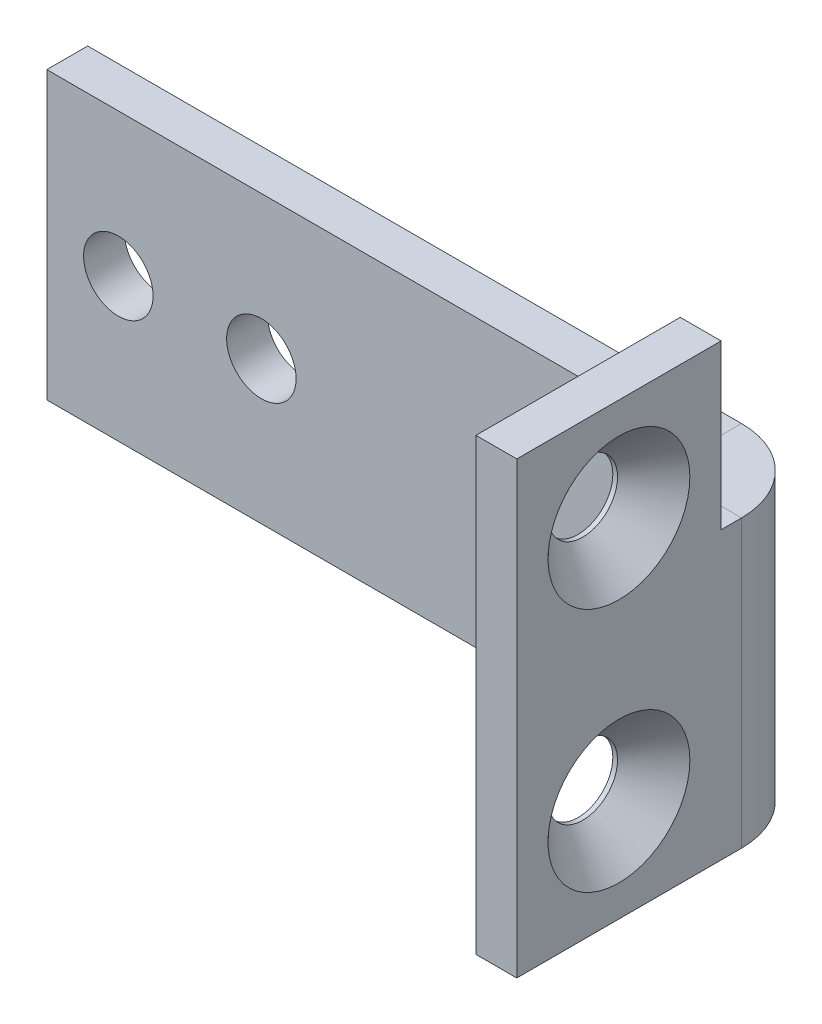
ISO-10303-21;
HEADER;
FILE_DESCRIPTION(('STEP AP214'),'2;1');
FILE_NAME('part.step','',(''),(''),'','','');
FILE_SCHEMA(('AUTOMOTIVE_DESIGN { 1 0 10303 214 1 1 1 1 }'));
ENDSEC;
DATA;
#1=APPLICATION_CONTEXT('core data for automotive mechanical design processes');
#2=APPLICATION_PROTOCOL_DEFINITION('international standard','automotive_design',2000,#1);
#3=PRODUCT_CONTEXT('',#1,'mechanical');
#4=PRODUCT('Part','Part','',(#3));
#5=PRODUCT_RELATED_PRODUCT_CATEGORY('part','',(#4));
#6=PRODUCT_DEFINITION_FORMATION('','',#4);
#7=PRODUCT_DEFINITION_CONTEXT('part definition',#1,'design');
#8=PRODUCT_DEFINITION('design','',#6,#7);
#9=PRODUCT_DEFINITION_SHAPE('','',#8);
#10=(LENGTH_UNIT() NAMED_UNIT(*) SI_UNIT(.MILLI.,.METRE.));
#11=(NAMED_UNIT(*) PLANE_ANGLE_UNIT() SI_UNIT($,.RADIAN.));
#12=(NAMED_UNIT(*) SI_UNIT($,.STERADIAN.) SOLID_ANGLE_UNIT());
#13=UNCERTAINTY_MEASURE_WITH_UNIT(LENGTH_MEASURE(1.E-05),#10,'distance_accuracy_value','');
#14=(GEOMETRIC_REPRESENTATION_CONTEXT(3) GLOBAL_UNCERTAINTY_ASSIGNED_CONTEXT((#13)) GLOBAL_UNIT_ASSIGNED_CONTEXT((#10,
#11,#12)) REPRESENTATION_CONTEXT('',''));
#15=CARTESIAN_POINT('',(0.,0.,0.));
#16=DIRECTION('',(0.,0.,1.));
#17=DIRECTION('',(1.,0.,0.));
#18=AXIS2_PLACEMENT_3D('',#15,#16,#17);
#19=CARTESIAN_POINT('',(0.,14.,-2.));
#20=DIRECTION('',(0.,1.,0.));
#21=DIRECTION('',(0.,0.,1.));
#22=AXIS2_PLACEMENT_3D('',#19,#20,#21);
#23=PLANE('',#22);
#24=DIRECTION('',(-1.,0.,0.));
#25=VECTOR('',#24,1.);
#26=CARTESIAN_POINT('',(0.,14.,0.));
#27=LINE('',#26,#25);
#28=CARTESIAN_POINT('',(32.,14.,0.));
#29=VERTEX_POINT('',#28);
#30=CARTESIAN_POINT('',(0.,14.,0.));
#31=VERTEX_POINT('',#30);
#32=EDGE_CURVE('E76',#29,#31,#27,.T.);
#33=ORIENTED_EDGE('',*,*,#32,.F.);
#34=DIRECTION('',(0.,0.,-1.));
#35=VECTOR('',#34,1.);
#36=CARTESIAN_POINT('',(32.,14.,0.));
#37=LINE('',#36,#35);
#38=CARTESIAN_POINT('',(32.,14.,-2.));
#39=VERTEX_POINT('',#38);
#40=EDGE_CURVE('E94',#29,#39,#37,.T.);
#41=ORIENTED_EDGE('',*,*,#40,.T.);
#42=DIRECTION('',(-1.,0.,0.));
#43=VECTOR('',#42,1.);
#44=CARTESIAN_POINT('',(0.,14.,-2.));
#45=LINE('',#44,#43);
#46=CARTESIAN_POINT('',(0.,14.,-2.));
#47=VERTEX_POINT('',#46);
#48=EDGE_CURVE('E61',#39,#47,#45,.T.);
#49=ORIENTED_EDGE('',*,*,#48,.T.);
#50=DIRECTION('',(0.,0.,1.));
#51=VECTOR('',#50,1.);
#52=CARTESIAN_POINT('',(0.,14.,-2.));
#53=LINE('',#52,#51);
#54=EDGE_CURVE('E11',#47,#31,#53,.T.);
#55=ORIENTED_EDGE('',*,*,#54,.T.);
#56=EDGE_LOOP('',(#33,#41,#49,#55));
#57=FACE_BOUND('',#56,.T.);
#58=ADVANCED_FACE('F36',(#57),#23,.T.);
#59=CARTESIAN_POINT('',(0.,0.,-2.));
#60=DIRECTION('',(0.,0.,-1.));
#61=DIRECTION('',(-1.,0.,0.));
#62=AXIS2_PLACEMENT_3D('',#59,#60,#61);
#63=PLANE('',#62);
#64=CARTESIAN_POINT('',(10.5,7.,-2.));
#65=DIRECTION('',(0.,0.,1.));
#66=DIRECTION('',(1.,0.,0.));
#67=AXIS2_PLACEMENT_3D('',#64,#65,#66);
#68=CIRCLE('',#67,1.7);
#69=CARTESIAN_POINT('',(12.2,7.,-2.));
#70=VERTEX_POINT('',#69);
#71=EDGE_CURVE('E106',#70,#70,#68,.T.);
#72=ORIENTED_EDGE('',*,*,#71,.T.);
#73=EDGE_LOOP('',(#72));
#74=FACE_BOUND('',#73,.T.);
#75=CARTESIAN_POINT('',(3.5,7.,-2.));
#76=DIRECTION('',(0.,0.,1.));
#77=DIRECTION('',(1.,0.,0.));
#78=AXIS2_PLACEMENT_3D('',#75,#76,#77);
#79=CIRCLE('',#78,1.7);
#80=CARTESIAN_POINT('',(5.2,7.,-2.));
#81=VERTEX_POINT('',#80);
#82=EDGE_CURVE('E120',#81,#81,#79,.T.);
#83=ORIENTED_EDGE('',*,*,#82,.T.);
#84=EDGE_LOOP('',(#83));
#85=FACE_BOUND('',#84,.T.);
#86=ORIENTED_EDGE('',*,*,#48,.F.);
#87=DIRECTION('',(0.,1.,0.));
#88=VECTOR('',#87,1.);
#89=CARTESIAN_POINT('',(32.,14.,-2.));
#90=LINE('',#89,#88);
#91=CARTESIAN_POINT('',(32.,0.,-2.));
#92=VERTEX_POINT('',#91);
#93=EDGE_CURVE('E180',#39,#92,#90,.F.);
#94=ORIENTED_EDGE('',*,*,#93,.T.);
#95=DIRECTION('',(1.,0.,0.));
#96=VECTOR('',#95,1.);
#97=CARTESIAN_POINT('',(0.,0.,-2.));
#98=LINE('',#97,#96);
#99=CARTESIAN_POINT('',(0.,0.,-2.));
#100=VERTEX_POINT('',#99);
#101=EDGE_CURVE('E194',#100,#92,#98,.T.);
#102=ORIENTED_EDGE('',*,*,#101,.F.);
#103=DIRECTION('',(0.,-1.,0.));
#104=VECTOR('',#103,1.);
#105=CARTESIAN_POINT('',(0.,0.,-2.));
#106=LINE('',#105,#104);
#107=EDGE_CURVE('E84',#47,#100,#106,.T.);
#108=ORIENTED_EDGE('',*,*,#107,.F.);
#109=EDGE_LOOP('',(#86,#94,#102,#108));
#110=FACE_BOUND('',#109,.T.);
#111=ADVANCED_FACE('F202',(#74,#85,#110),#63,.T.);
#112=CARTESIAN_POINT('',(0.,0.,0.));
#113=DIRECTION('',(0.,0.,-1.));
#114=DIRECTION('',(-1.,0.,0.));
#115=AXIS2_PLACEMENT_3D('',#112,#113,#114);
#116=PLANE('',#115);
#117=CARTESIAN_POINT('',(10.5,7.,0.));
#118=DIRECTION('',(0.,0.,1.));
#119=DIRECTION('',(1.,0.,0.));
#120=AXIS2_PLACEMENT_3D('',#117,#118,#119);
#121=CIRCLE('',#120,1.7);
#122=CARTESIAN_POINT('',(12.2,7.,0.));
#123=VERTEX_POINT('',#122);
#124=EDGE_CURVE('E101',#123,#123,#121,.T.);
#125=ORIENTED_EDGE('',*,*,#124,.F.);
#126=EDGE_LOOP('',(#125));
#127=FACE_BOUND('',#126,.T.);
#128=CARTESIAN_POINT('',(3.5,7.,0.));
#129=DIRECTION('',(0.,0.,1.));
#130=DIRECTION('',(1.,0.,0.));
#131=AXIS2_PLACEMENT_3D('',#128,#129,#130);
#132=CIRCLE('',#131,1.7);
#133=CARTESIAN_POINT('',(5.2,7.,0.));
#134=VERTEX_POINT('',#133);
#135=EDGE_CURVE('E118',#134,#134,#132,.T.);
#136=ORIENTED_EDGE('',*,*,#135,.F.);
#137=EDGE_LOOP('',(#136));
#138=FACE_BOUND('',#137,.T.);
#139=DIRECTION('',(0.,1.,0.));
#140=VECTOR('',#139,1.);
#141=CARTESIAN_POINT('',(32.,14.,0.));
#142=LINE('',#141,#140);
#143=CARTESIAN_POINT('',(32.,0.,0.));
#144=VERTEX_POINT('',#143);
#145=EDGE_CURVE('E83',#29,#144,#142,.F.);
#146=ORIENTED_EDGE('',*,*,#145,.F.);
#147=ORIENTED_EDGE('',*,*,#32,.T.);
#148=DIRECTION('',(0.,-1.,0.));
#149=VECTOR('',#148,1.);
#150=CARTESIAN_POINT('',(0.,0.,0.));
#151=LINE('',#150,#149);
#152=CARTESIAN_POINT('',(0.,0.,0.));
#153=VERTEX_POINT('',#152);
#154=EDGE_CURVE('E80',#31,#153,#151,.T.);
#155=ORIENTED_EDGE('',*,*,#154,.T.);
#156=DIRECTION('',(1.,0.,0.));
#157=VECTOR('',#156,1.);
#158=CARTESIAN_POINT('',(0.,0.,0.));
#159=LINE('',#158,#157);
#160=EDGE_CURVE('E85',#153,#144,#159,.T.);
#161=ORIENTED_EDGE('',*,*,#160,.T.);
#162=EDGE_LOOP('',(#146,#147,#155,#161));
#163=FACE_BOUND('',#162,.T.);
#164=ADVANCED_FACE('F77',(#127,#138,#163),#116,.F.);
#165=CARTESIAN_POINT('',(0.,0.,-2.));
#166=DIRECTION('',(-1.,0.,0.));
#167=DIRECTION('',(0.,0.,1.));
#168=AXIS2_PLACEMENT_3D('',#165,#166,#167);
#169=PLANE('',#168);
#170=ORIENTED_EDGE('',*,*,#154,.F.);
#171=ORIENTED_EDGE('',*,*,#54,.F.);
#172=ORIENTED_EDGE('',*,*,#107,.T.);
#173=DIRECTION('',(0.,0.,1.));
#174=VECTOR('',#173,1.);
#175=CARTESIAN_POINT('',(0.,0.,-2.));
#176=LINE('',#175,#174);
#177=EDGE_CURVE('E45',#100,#153,#176,.T.);
#178=ORIENTED_EDGE('',*,*,#177,.T.);
#179=EDGE_LOOP('',(#170,#171,#172,#178));
#180=FACE_BOUND('',#179,.T.);
#181=ADVANCED_FACE('F38',(#180),#169,.T.);
#182=CARTESIAN_POINT('',(0.,0.,-2.));
#183=DIRECTION('',(0.,-1.,0.));
#184=DIRECTION('',(0.,0.,-1.));
#185=AXIS2_PLACEMENT_3D('',#182,#183,#184);
#186=PLANE('',#185);
#187=DIRECTION('',(0.,0.,-1.));
#188=VECTOR('',#187,1.);
#189=CARTESIAN_POINT('',(32.,0.,0.));
#190=LINE('',#189,#188);
#191=EDGE_CURVE('E91',#144,#92,#190,.T.);
#192=ORIENTED_EDGE('',*,*,#191,.F.);
#193=ORIENTED_EDGE('',*,*,#160,.F.);
#194=ORIENTED_EDGE('',*,*,#177,.F.);
#195=ORIENTED_EDGE('',*,*,#101,.T.);
#196=EDGE_LOOP('',(#192,#193,#194,#195));
#197=FACE_BOUND('',#196,.T.);
#198=ADVANCED_FACE('F199',(#197),#186,.T.);
#199=CARTESIAN_POINT('',(32.,0.,2.));
#200=DIRECTION('',(0.,-1.,0.));
#201=DIRECTION('',(0.,0.,-1.));
#202=AXIS2_PLACEMENT_3D('',#199,#200,#201);
#203=PLANE('',#202);
#204=DIRECTION('',(1.,0.,0.));
#205=VECTOR('',#204,1.);
#206=CARTESIAN_POINT('',(34.,0.,1.99999999999999));
#207=LINE('',#206,#205);
#208=CARTESIAN_POINT('',(34.,0.,1.99999999999999));
#209=VERTEX_POINT('',#208);
#210=CARTESIAN_POINT('',(36.,0.,1.99999999999999));
#211=VERTEX_POINT('',#210);
#212=EDGE_CURVE('E123',#209,#211,#207,.T.);
#213=ORIENTED_EDGE('',*,*,#212,.F.);
#214=CARTESIAN_POINT('',(32.,0.,2.));
#215=DIRECTION('',(0.,1.,0.));
#216=DIRECTION('',(0.,0.,1.));
#217=AXIS2_PLACEMENT_3D('',#214,#215,#216);
#218=CIRCLE('',#217,2.);
#219=EDGE_CURVE('E187',#144,#209,#218,.F.);
#220=ORIENTED_EDGE('',*,*,#219,.F.);
#221=ORIENTED_EDGE('',*,*,#191,.T.);
#222=CARTESIAN_POINT('',(32.,0.,2.));
#223=DIRECTION('',(0.,1.,0.));
#224=DIRECTION('',(0.,0.,1.));
#225=AXIS2_PLACEMENT_3D('',#222,#223,#224);
#226=CIRCLE('',#225,4.);
#227=EDGE_CURVE('E53',#92,#211,#226,.F.);
#228=ORIENTED_EDGE('',*,*,#227,.T.);
#229=EDGE_LOOP('',(#213,#220,#221,#228));
#230=FACE_BOUND('',#229,.T.);
#231=ADVANCED_FACE('F287',(#230),#203,.T.);
#232=CARTESIAN_POINT('',(32.,14.,2.));
#233=DIRECTION('',(0.,-1.,0.));
#234=DIRECTION('',(0.,0.,-1.));
#235=AXIS2_PLACEMENT_3D('',#232,#233,#234);
#236=PLANE('',#235);
#237=CARTESIAN_POINT('',(32.,14.,2.));
#238=DIRECTION('',(0.,1.,0.));
#239=DIRECTION('',(0.,0.,1.));
#240=AXIS2_PLACEMENT_3D('',#237,#238,#239);
#241=CIRCLE('',#240,2.);
#242=CARTESIAN_POINT('',(34.,14.,1.99999999999999));
#243=VERTEX_POINT('',#242);
#244=EDGE_CURVE('E179',#243,#29,#241,.T.);
#245=ORIENTED_EDGE('',*,*,#244,.F.);
#246=DIRECTION('',(1.,0.,0.));
#247=VECTOR('',#246,1.);
#248=CARTESIAN_POINT('',(34.,14.,1.99999999999999));
#249=LINE('',#248,#247);
#250=CARTESIAN_POINT('',(36.,14.,1.99999999999999));
#251=VERTEX_POINT('',#250);
#252=EDGE_CURVE('E129',#243,#251,#249,.T.);
#253=ORIENTED_EDGE('',*,*,#252,.T.);
#254=CARTESIAN_POINT('',(32.,14.,2.));
#255=DIRECTION('',(0.,1.,0.));
#256=DIRECTION('',(0.,0.,1.));
#257=AXIS2_PLACEMENT_3D('',#254,#255,#256);
#258=CIRCLE('',#257,4.);
#259=EDGE_CURVE('E183',#251,#39,#258,.T.);
#260=ORIENTED_EDGE('',*,*,#259,.T.);
#261=ORIENTED_EDGE('',*,*,#40,.F.);
#262=EDGE_LOOP('',(#245,#253,#260,#261));
#263=FACE_BOUND('',#262,.T.);
#264=ADVANCED_FACE('F211',(#263),#236,.F.);
#265=CARTESIAN_POINT('',(32.,14.,2.));
#266=DIRECTION('',(0.,1.,0.));
#267=DIRECTION('',(1.,0.,0.));
#268=AXIS2_PLACEMENT_3D('',#265,#266,#267);
#269=CYLINDRICAL_SURFACE('',#268,4.);
#270=ORIENTED_EDGE('',*,*,#93,.F.);
#271=ORIENTED_EDGE('',*,*,#259,.F.);
#272=DIRECTION('',(0.,1.,0.));
#273=VECTOR('',#272,1.);
#274=CARTESIAN_POINT('',(36.,0.,1.99999999999999));
#275=LINE('',#274,#273);
#276=EDGE_CURVE('E132',#211,#251,#275,.T.);
#277=ORIENTED_EDGE('',*,*,#276,.F.);
#278=ORIENTED_EDGE('',*,*,#227,.F.);
#279=EDGE_LOOP('',(#270,#271,#277,#278));
#280=FACE_BOUND('',#279,.T.);
#281=ADVANCED_FACE('F204',(#280),#269,.T.);
#282=CARTESIAN_POINT('',(32.,14.,2.));
#283=DIRECTION('',(0.,1.,0.));
#284=DIRECTION('',(1.,0.,0.));
#285=AXIS2_PLACEMENT_3D('',#282,#283,#284);
#286=CYLINDRICAL_SURFACE('',#285,2.);
#287=ORIENTED_EDGE('',*,*,#145,.T.);
#288=ORIENTED_EDGE('',*,*,#219,.T.);
#289=DIRECTION('',(0.,1.,0.));
#290=VECTOR('',#289,1.);
#291=CARTESIAN_POINT('',(34.,0.,1.99999999999999));
#292=LINE('',#291,#290);
#293=EDGE_CURVE('E126',#209,#243,#292,.T.);
#294=ORIENTED_EDGE('',*,*,#293,.T.);
#295=ORIENTED_EDGE('',*,*,#244,.T.);
#296=EDGE_LOOP('',(#287,#288,#294,#295));
#297=FACE_BOUND('',#296,.T.);
#298=ADVANCED_FACE('F254',(#297),#286,.F.);
#299=CARTESIAN_POINT('',(36.,0.,0.));
#300=DIRECTION('',(0.,1.,0.));
#301=DIRECTION('',(0.,0.,1.));
#302=AXIS2_PLACEMENT_3D('',#299,#300,#301);
#303=PLANE('',#302);
#304=ORIENTED_EDGE('',*,*,#212,.T.);
#305=DIRECTION('',(0.,0.,-1.));
#306=VECTOR('',#305,1.);
#307=CARTESIAN_POINT('',(36.,0.,0.));
#308=LINE('',#307,#306);
#309=CARTESIAN_POINT('',(36.,0.,13.));
#310=VERTEX_POINT('',#309);
#311=EDGE_CURVE('E138',#310,#211,#308,.T.);
#312=ORIENTED_EDGE('',*,*,#311,.F.);
#313=DIRECTION('',(-1.,0.,0.));
#314=VECTOR('',#313,1.);
#315=CARTESIAN_POINT('',(36.,0.,13.));
#316=LINE('',#315,#314);
#317=CARTESIAN_POINT('',(34.,0.,13.));
#318=VERTEX_POINT('',#317);
#319=EDGE_CURVE('E154',#310,#318,#316,.T.);
#320=ORIENTED_EDGE('',*,*,#319,.T.);
#321=DIRECTION('',(0.,0.,-1.));
#322=VECTOR('',#321,1.);
#323=CARTESIAN_POINT('',(34.,0.,0.));
#324=LINE('',#323,#322);
#325=EDGE_CURVE('E137',#318,#209,#324,.T.);
#326=ORIENTED_EDGE('',*,*,#325,.T.);
#327=EDGE_LOOP('',(#304,#312,#320,#326));
#328=FACE_BOUND('',#327,.T.);
#329=ADVANCED_FACE('F261',(#328),#303,.F.);
#330=CARTESIAN_POINT('',(36.,14.,2.99999999999999));
#331=DIRECTION('',(0.,-1.,0.));
#332=DIRECTION('',(0.,0.,-1.));
#333=AXIS2_PLACEMENT_3D('',#330,#331,#332);
#334=PLANE('',#333);
#335=ORIENTED_EDGE('',*,*,#252,.F.);
#336=DIRECTION('',(0.,0.,1.));
#337=VECTOR('',#336,1.);
#338=CARTESIAN_POINT('',(34.,14.,3.));
#339=LINE('',#338,#337);
#340=CARTESIAN_POINT('',(34.,14.,3.));
#341=VERTEX_POINT('',#340);
#342=EDGE_CURVE('E157',#243,#341,#339,.T.);
#343=ORIENTED_EDGE('',*,*,#342,.T.);
#344=DIRECTION('',(-1.,0.,0.));
#345=VECTOR('',#344,1.);
#346=CARTESIAN_POINT('',(36.,14.,2.99999999999999));
#347=LINE('',#346,#345);
#348=CARTESIAN_POINT('',(36.,14.,2.99999999999999));
#349=VERTEX_POINT('',#348);
#350=EDGE_CURVE('E176',#349,#341,#347,.T.);
#351=ORIENTED_EDGE('',*,*,#350,.F.);
#352=DIRECTION('',(0.,0.,1.));
#353=VECTOR('',#352,1.);
#354=CARTESIAN_POINT('',(36.,14.,2.99999999999999));
#355=LINE('',#354,#353);
#356=EDGE_CURVE('E141',#251,#349,#355,.T.);
#357=ORIENTED_EDGE('',*,*,#356,.F.);
#358=EDGE_LOOP('',(#335,#343,#351,#357));
#359=FACE_BOUND('',#358,.T.);
#360=ADVANCED_FACE('F225',(#359),#334,.F.);
#361=CARTESIAN_POINT('',(36.,0.,-1.34018097226142E-13));
#362=DIRECTION('',(1.,0.,0.));
#363=DIRECTION('',(0.,0.,-1.));
#364=AXIS2_PLACEMENT_3D('',#361,#362,#363);
#365=PLANE('',#364);
#366=CARTESIAN_POINT('',(36.,5.,7.99999999999999));
#367=DIRECTION('',(1.,0.,0.));
#368=DIRECTION('',(0.,0.,-1.));
#369=AXIS2_PLACEMENT_3D('',#366,#367,#368);
#370=CIRCLE('',#369,3.47);
#371=CARTESIAN_POINT('',(36.,5.,4.52999999999999));
#372=VERTEX_POINT('',#371);
#373=EDGE_CURVE('E329',#372,#372,#370,.T.);
#374=ORIENTED_EDGE('',*,*,#373,.F.);
#375=EDGE_LOOP('',(#374));
#376=FACE_BOUND('',#375,.T.);
#377=CARTESIAN_POINT('',(36.,17.,7.99999999999999));
#378=DIRECTION('',(1.,0.,0.));
#379=DIRECTION('',(0.,0.,-1.));
#380=AXIS2_PLACEMENT_3D('',#377,#378,#379);
#381=CIRCLE('',#380,3.47);
#382=CARTESIAN_POINT('',(36.,17.,4.52999999999999));
#383=VERTEX_POINT('',#382);
#384=EDGE_CURVE('E109',#383,#383,#381,.T.);
#385=ORIENTED_EDGE('',*,*,#384,.F.);
#386=EDGE_LOOP('',(#385));
#387=FACE_BOUND('',#386,.T.);
#388=ORIENTED_EDGE('',*,*,#311,.T.);
#389=ORIENTED_EDGE('',*,*,#276,.T.);
#390=ORIENTED_EDGE('',*,*,#356,.T.);
#391=DIRECTION('',(0.,1.,0.));
#392=VECTOR('',#391,1.);
#393=CARTESIAN_POINT('',(36.,14.,2.99999999999999));
#394=LINE('',#393,#392);
#395=CARTESIAN_POINT('',(36.,22.,2.99999999999999));
#396=VERTEX_POINT('',#395);
#397=EDGE_CURVE('E145',#349,#396,#394,.T.);
#398=ORIENTED_EDGE('',*,*,#397,.T.);
#399=DIRECTION('',(0.,0.,1.));
#400=VECTOR('',#399,1.);
#401=CARTESIAN_POINT('',(36.,22.,2.99999999999999));
#402=LINE('',#401,#400);
#403=CARTESIAN_POINT('',(36.,22.,13.));
#404=VERTEX_POINT('',#403);
#405=EDGE_CURVE('E148',#396,#404,#402,.T.);
#406=ORIENTED_EDGE('',*,*,#405,.T.);
#407=DIRECTION('',(0.,-1.,0.));
#408=VECTOR('',#407,1.);
#409=CARTESIAN_POINT('',(36.,22.,13.));
#410=LINE('',#409,#408);
#411=EDGE_CURVE('E151',#404,#310,#410,.T.);
#412=ORIENTED_EDGE('',*,*,#411,.T.);
#413=EDGE_LOOP('',(#388,#389,#390,#398,#406,#412));
#414=FACE_BOUND('',#413,.T.);
#415=ADVANCED_FACE('F221',(#376,#387,#414),#365,.T.);
#416=CARTESIAN_POINT('',(34.,0.,-1.27035134548455E-13));
#417=DIRECTION('',(1.,0.,0.));
#418=DIRECTION('',(0.,0.,-1.));
#419=AXIS2_PLACEMENT_3D('',#416,#417,#418);
#420=PLANE('',#419);
#421=CARTESIAN_POINT('',(34.,5.,7.99999999999999));
#422=DIRECTION('',(1.,0.,0.));
#423=DIRECTION('',(0.,0.,-1.));
#424=AXIS2_PLACEMENT_3D('',#421,#422,#423);
#425=CIRCLE('',#424,1.69999999999999);
#426=CARTESIAN_POINT('',(34.,5.,6.3));
#427=VERTEX_POINT('',#426);
#428=EDGE_CURVE('E40',#427,#427,#425,.T.);
#429=ORIENTED_EDGE('',*,*,#428,.T.);
#430=EDGE_LOOP('',(#429));
#431=FACE_BOUND('',#430,.T.);
#432=CARTESIAN_POINT('',(34.,17.,7.99999999999999));
#433=DIRECTION('',(1.,0.,0.));
#434=DIRECTION('',(0.,0.,-1.));
#435=AXIS2_PLACEMENT_3D('',#432,#433,#434);
#436=CIRCLE('',#435,1.7);
#437=CARTESIAN_POINT('',(34.,17.,6.3));
#438=VERTEX_POINT('',#437);
#439=EDGE_CURVE('E99',#438,#438,#436,.T.);
#440=ORIENTED_EDGE('',*,*,#439,.T.);
#441=EDGE_LOOP('',(#440));
#442=FACE_BOUND('',#441,.T.);
#443=ORIENTED_EDGE('',*,*,#293,.F.);
#444=ORIENTED_EDGE('',*,*,#325,.F.);
#445=DIRECTION('',(0.,-1.,0.));
#446=VECTOR('',#445,1.);
#447=CARTESIAN_POINT('',(34.,22.,13.));
#448=LINE('',#447,#446);
#449=CARTESIAN_POINT('',(34.,22.,13.));
#450=VERTEX_POINT('',#449);
#451=EDGE_CURVE('E142',#450,#318,#448,.T.);
#452=ORIENTED_EDGE('',*,*,#451,.F.);
#453=DIRECTION('',(0.,0.,1.));
#454=VECTOR('',#453,1.);
#455=CARTESIAN_POINT('',(34.,22.,3.));
#456=LINE('',#455,#454);
#457=CARTESIAN_POINT('',(34.,22.,3.));
#458=VERTEX_POINT('',#457);
#459=EDGE_CURVE('E163',#458,#450,#456,.T.);
#460=ORIENTED_EDGE('',*,*,#459,.F.);
#461=DIRECTION('',(0.,1.,0.));
#462=VECTOR('',#461,1.);
#463=CARTESIAN_POINT('',(34.,14.,3.));
#464=LINE('',#463,#462);
#465=EDGE_CURVE('E160',#341,#458,#464,.T.);
#466=ORIENTED_EDGE('',*,*,#465,.F.);
#467=ORIENTED_EDGE('',*,*,#342,.F.);
#468=EDGE_LOOP('',(#443,#444,#452,#460,#466,#467));
#469=FACE_BOUND('',#468,.T.);
#470=ADVANCED_FACE('F258',(#431,#442,#469),#420,.F.);
#471=CARTESIAN_POINT('',(36.,14.,2.99999999999999));
#472=DIRECTION('',(0.,0.,1.));
#473=DIRECTION('',(1.,0.,0.));
#474=AXIS2_PLACEMENT_3D('',#471,#472,#473);
#475=PLANE('',#474);
#476=ORIENTED_EDGE('',*,*,#465,.T.);
#477=DIRECTION('',(-1.,0.,0.));
#478=VECTOR('',#477,1.);
#479=CARTESIAN_POINT('',(36.,22.,2.99999999999999));
#480=LINE('',#479,#478);
#481=EDGE_CURVE('E173',#396,#458,#480,.T.);
#482=ORIENTED_EDGE('',*,*,#481,.F.);
#483=ORIENTED_EDGE('',*,*,#397,.F.);
#484=ORIENTED_EDGE('',*,*,#350,.T.);
#485=EDGE_LOOP('',(#476,#482,#483,#484));
#486=FACE_BOUND('',#485,.T.);
#487=ADVANCED_FACE('F234',(#486),#475,.F.);
#488=CARTESIAN_POINT('',(36.,22.,2.99999999999999));
#489=DIRECTION('',(0.,-1.,0.));
#490=DIRECTION('',(0.,0.,-1.));
#491=AXIS2_PLACEMENT_3D('',#488,#489,#490);
#492=PLANE('',#491);
#493=ORIENTED_EDGE('',*,*,#459,.T.);
#494=DIRECTION('',(-1.,0.,0.));
#495=VECTOR('',#494,1.);
#496=CARTESIAN_POINT('',(36.,22.,13.));
#497=LINE('',#496,#495);
#498=EDGE_CURVE('E170',#404,#450,#497,.T.);
#499=ORIENTED_EDGE('',*,*,#498,.F.);
#500=ORIENTED_EDGE('',*,*,#405,.F.);
#501=ORIENTED_EDGE('',*,*,#481,.T.);
#502=EDGE_LOOP('',(#493,#499,#500,#501));
#503=FACE_BOUND('',#502,.T.);
#504=ADVANCED_FACE('F268',(#503),#492,.F.);
#505=CARTESIAN_POINT('',(36.,22.,13.));
#506=DIRECTION('',(0.,0.,-1.));
#507=DIRECTION('',(-1.,0.,0.));
#508=AXIS2_PLACEMENT_3D('',#505,#506,#507);
#509=PLANE('',#508);
#510=ORIENTED_EDGE('',*,*,#451,.T.);
#511=ORIENTED_EDGE('',*,*,#319,.F.);
#512=ORIENTED_EDGE('',*,*,#411,.F.);
#513=ORIENTED_EDGE('',*,*,#498,.T.);
#514=EDGE_LOOP('',(#510,#511,#512,#513));
#515=FACE_BOUND('',#514,.T.);
#516=ADVANCED_FACE('F265',(#515),#509,.F.);
#517=CARTESIAN_POINT('',(3.5,7.,-2.));
#518=DIRECTION('',(0.,0.,1.));
#519=DIRECTION('',(1.,0.,0.));
#520=AXIS2_PLACEMENT_3D('',#517,#518,#519);
#521=CYLINDRICAL_SURFACE('',#520,1.7);
#522=ORIENTED_EDGE('',*,*,#82,.F.);
#523=EDGE_LOOP('',(#522));
#524=FACE_BOUND('',#523,.T.);
#525=ORIENTED_EDGE('',*,*,#135,.T.);
#526=EDGE_LOOP('',(#525));
#527=FACE_BOUND('',#526,.T.);
#528=ADVANCED_FACE('F275',(#524,#527),#521,.F.);
#529=CARTESIAN_POINT('',(10.5,7.,-2.));
#530=DIRECTION('',(0.,0.,1.));
#531=DIRECTION('',(1.,0.,0.));
#532=AXIS2_PLACEMENT_3D('',#529,#530,#531);
#533=CYLINDRICAL_SURFACE('',#532,1.7);
#534=ORIENTED_EDGE('',*,*,#71,.F.);
#535=EDGE_LOOP('',(#534));
#536=FACE_BOUND('',#535,.T.);
#537=ORIENTED_EDGE('',*,*,#124,.T.);
#538=EDGE_LOOP('',(#537));
#539=FACE_BOUND('',#538,.T.);
#540=ADVANCED_FACE('F305',(#536,#539),#533,.F.);
#541=CARTESIAN_POINT('',(36.,17.,7.99999999999999));
#542=DIRECTION('',(1.,0.,0.));
#543=DIRECTION('',(0.,0.,-1.));
#544=AXIS2_PLACEMENT_3D('',#541,#542,#543);
#545=CYLINDRICAL_SURFACE('',#544,1.7);
#546=CARTESIAN_POINT('',(34.23,17.,7.99999999999999));
#547=DIRECTION('',(1.,0.,0.));
#548=DIRECTION('',(0.,0.,-1.));
#549=AXIS2_PLACEMENT_3D('',#546,#547,#548);
#550=CIRCLE('',#549,1.7);
#551=CARTESIAN_POINT('',(34.23,17.,6.29999999999999));
#552=VERTEX_POINT('',#551);
#553=EDGE_CURVE('E102',#552,#552,#550,.T.);
#554=ORIENTED_EDGE('',*,*,#553,.T.);
#555=EDGE_LOOP('',(#554));
#556=FACE_BOUND('',#555,.T.);
#557=ORIENTED_EDGE('',*,*,#439,.F.);
#558=EDGE_LOOP('',(#557));
#559=FACE_BOUND('',#558,.T.);
#560=ADVANCED_FACE('F311',(#556,#559),#545,.F.);
#561=CARTESIAN_POINT('',(36.,17.,7.99999999999999));
#562=DIRECTION('',(1.,0.,0.));
#563=DIRECTION('',(0.,0.,-1.));
#564=AXIS2_PLACEMENT_3D('',#561,#562,#563);
#565=CONICAL_SURFACE('',#564,3.47,0.785398163397448);
#566=ORIENTED_EDGE('',*,*,#553,.F.);
#567=EDGE_LOOP('',(#566));
#568=FACE_BOUND('',#567,.T.);
#569=ORIENTED_EDGE('',*,*,#384,.T.);
#570=EDGE_LOOP('',(#569));
#571=FACE_BOUND('',#570,.T.);
#572=ADVANCED_FACE('F340',(#568,#571),#565,.F.);
#573=CARTESIAN_POINT('',(36.,5.,7.99999999999999));
#574=DIRECTION('',(1.,0.,0.));
#575=DIRECTION('',(0.,0.,-1.));
#576=AXIS2_PLACEMENT_3D('',#573,#574,#575);
#577=CYLINDRICAL_SURFACE('',#576,1.69999999999999);
#578=CARTESIAN_POINT('',(34.23,5.,7.99999999999999));
#579=DIRECTION('',(1.,0.,0.));
#580=DIRECTION('',(0.,0.,-1.));
#581=AXIS2_PLACEMENT_3D('',#578,#579,#580);
#582=CIRCLE('',#581,1.7);
#583=CARTESIAN_POINT('',(34.23,5.,6.29999999999999));
#584=VERTEX_POINT('',#583);
#585=EDGE_CURVE('E327',#584,#584,#582,.T.);
#586=ORIENTED_EDGE('',*,*,#585,.T.);
#587=EDGE_LOOP('',(#586));
#588=FACE_BOUND('',#587,.T.);
#589=ORIENTED_EDGE('',*,*,#428,.F.);
#590=EDGE_LOOP('',(#589));
#591=FACE_BOUND('',#590,.T.);
#592=ADVANCED_FACE('F342',(#588,#591),#577,.F.);
#593=CARTESIAN_POINT('',(36.,5.,7.99999999999999));
#594=DIRECTION('',(1.,0.,0.));
#595=DIRECTION('',(0.,0.,-1.));
#596=AXIS2_PLACEMENT_3D('',#593,#594,#595);
#597=CONICAL_SURFACE('',#596,3.47,0.785398163397449);
#598=ORIENTED_EDGE('',*,*,#585,.F.);
#599=EDGE_LOOP('',(#598));
#600=FACE_BOUND('',#599,.T.);
#601=ORIENTED_EDGE('',*,*,#373,.T.);
#602=EDGE_LOOP('',(#601));
#603=FACE_BOUND('',#602,.T.);
#604=ADVANCED_FACE('F336',(#600,#603),#597,.F.);
#605=CLOSED_SHELL('',(#58,#111,#164,#181,#198,#231,#264,#281,#298,#329,#360,#415,#470,#487,#504,
#516,#528,#540,#560,#572,#592,#604));
#606=MANIFOLD_SOLID_BREP('B2',#605);
#607=ADVANCED_BREP_SHAPE_REPRESENTATION('',(#18,#606),#14);
#608=SHAPE_DEFINITION_REPRESENTATION(#9,#607);
ENDSEC;
END-ISO-10303-21;
